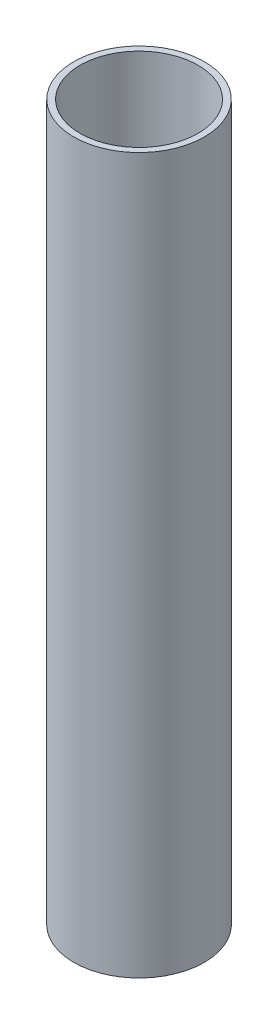
ISO-10303-21;
HEADER;
FILE_DESCRIPTION(('STEP AP214'),'2;1');
FILE_NAME('part.step','',(''),(''),'','','');
FILE_SCHEMA(('AUTOMOTIVE_DESIGN { 1 0 10303 214 1 1 1 1 }'));
ENDSEC;
DATA;
#1=APPLICATION_CONTEXT('core data for automotive mechanical design processes');
#2=APPLICATION_PROTOCOL_DEFINITION('international standard','automotive_design',2000,#1);
#3=PRODUCT_CONTEXT('',#1,'mechanical');
#4=PRODUCT('Part','Part','',(#3));
#5=PRODUCT_RELATED_PRODUCT_CATEGORY('part','',(#4));
#6=PRODUCT_DEFINITION_FORMATION('','',#4);
#7=PRODUCT_DEFINITION_CONTEXT('part definition',#1,'design');
#8=PRODUCT_DEFINITION('design','',#6,#7);
#9=PRODUCT_DEFINITION_SHAPE('','',#8);
#10=(LENGTH_UNIT() NAMED_UNIT(*) SI_UNIT(.MILLI.,.METRE.));
#11=(NAMED_UNIT(*) PLANE_ANGLE_UNIT() SI_UNIT($,.RADIAN.));
#12=(NAMED_UNIT(*) SI_UNIT($,.STERADIAN.) SOLID_ANGLE_UNIT());
#13=UNCERTAINTY_MEASURE_WITH_UNIT(LENGTH_MEASURE(1.E-05),#10,'distance_accuracy_value','');
#14=(GEOMETRIC_REPRESENTATION_CONTEXT(3) GLOBAL_UNCERTAINTY_ASSIGNED_CONTEXT((#13)) GLOBAL_UNIT_ASSIGNED_CONTEXT((#10,
#11,#12)) REPRESENTATION_CONTEXT('',''));
#15=CARTESIAN_POINT('',(0.,0.,0.));
#16=DIRECTION('',(0.,0.,1.));
#17=DIRECTION('',(1.,0.,0.));
#18=AXIS2_PLACEMENT_3D('',#15,#16,#17);
#19=CARTESIAN_POINT('',(0.,230.,0.));
#20=DIRECTION('',(0.,1.,0.));
#21=DIRECTION('',(0.,0.,1.));
#22=AXIS2_PLACEMENT_3D('',#19,#20,#21);
#23=PLANE('',#22);
#24=CARTESIAN_POINT('',(0.,230.,0.));
#25=DIRECTION('',(0.,1.,0.));
#26=DIRECTION('',(1.,0.,0.));
#27=AXIS2_PLACEMENT_3D('',#24,#25,#26);
#28=CIRCLE('',#27,21.);
#29=CARTESIAN_POINT('',(21.,230.,0.));
#30=VERTEX_POINT('',#29);
#31=EDGE_CURVE('E11',#30,#30,#28,.T.);
#32=ORIENTED_EDGE('',*,*,#31,.T.);
#33=EDGE_LOOP('',(#32));
#34=FACE_BOUND('',#33,.T.);
#35=CARTESIAN_POINT('',(0.,230.,0.));
#36=DIRECTION('',(0.,1.,0.));
#37=DIRECTION('',(0.,0.,1.));
#38=AXIS2_PLACEMENT_3D('',#35,#36,#37);
#39=CIRCLE('',#38,19.);
#40=CARTESIAN_POINT('',(0.,230.,19.));
#41=VERTEX_POINT('',#40);
#42=EDGE_CURVE('E58',#41,#41,#39,.T.);
#43=ORIENTED_EDGE('',*,*,#42,.F.);
#44=EDGE_LOOP('',(#43));
#45=FACE_BOUND('',#44,.T.);
#46=ADVANCED_FACE('F45',(#34,#45),#23,.T.);
#47=CARTESIAN_POINT('',(0.,0.,0.));
#48=DIRECTION('',(0.,1.,0.));
#49=DIRECTION('',(0.,0.,1.));
#50=AXIS2_PLACEMENT_3D('',#47,#48,#49);
#51=PLANE('',#50);
#52=CARTESIAN_POINT('',(0.,0.,0.));
#53=DIRECTION('',(0.,1.,0.));
#54=DIRECTION('',(1.,0.,0.));
#55=AXIS2_PLACEMENT_3D('',#52,#53,#54);
#56=CIRCLE('',#55,21.);
#57=CARTESIAN_POINT('',(21.,0.,0.));
#58=VERTEX_POINT('',#57);
#59=EDGE_CURVE('E49',#58,#58,#56,.T.);
#60=ORIENTED_EDGE('',*,*,#59,.F.);
#61=EDGE_LOOP('',(#60));
#62=FACE_BOUND('',#61,.T.);
#63=CARTESIAN_POINT('',(0.,0.,0.));
#64=DIRECTION('',(0.,1.,0.));
#65=DIRECTION('',(0.,0.,1.));
#66=AXIS2_PLACEMENT_3D('',#63,#64,#65);
#67=CIRCLE('',#66,19.);
#68=CARTESIAN_POINT('',(0.,0.,19.));
#69=VERTEX_POINT('',#68);
#70=EDGE_CURVE('E60',#69,#69,#67,.T.);
#71=ORIENTED_EDGE('',*,*,#70,.T.);
#72=EDGE_LOOP('',(#71));
#73=FACE_BOUND('',#72,.T.);
#74=ADVANCED_FACE('F72',(#62,#73),#51,.F.);
#75=CARTESIAN_POINT('',(0.,230.,0.));
#76=DIRECTION('',(0.,-1.,0.));
#77=DIRECTION('',(0.,0.,-1.));
#78=AXIS2_PLACEMENT_3D('',#75,#76,#77);
#79=CYLINDRICAL_SURFACE('',#78,21.);
#80=ORIENTED_EDGE('',*,*,#31,.F.);
#81=EDGE_LOOP('',(#80));
#82=FACE_BOUND('',#81,.T.);
#83=ORIENTED_EDGE('',*,*,#59,.T.);
#84=EDGE_LOOP('',(#83));
#85=FACE_BOUND('',#84,.T.);
#86=ADVANCED_FACE('F47',(#82,#85),#79,.T.);
#87=CARTESIAN_POINT('',(0.,230.,0.));
#88=DIRECTION('',(0.,-1.,0.));
#89=DIRECTION('',(0.,0.,-1.));
#90=AXIS2_PLACEMENT_3D('',#87,#88,#89);
#91=CYLINDRICAL_SURFACE('',#90,19.);
#92=ORIENTED_EDGE('',*,*,#42,.T.);
#93=EDGE_LOOP('',(#92));
#94=FACE_BOUND('',#93,.T.);
#95=ORIENTED_EDGE('',*,*,#70,.F.);
#96=EDGE_LOOP('',(#95));
#97=FACE_BOUND('',#96,.T.);
#98=ADVANCED_FACE('F68',(#94,#97),#91,.F.);
#99=CLOSED_SHELL('',(#46,#74,#86,#98));
#100=MANIFOLD_SOLID_BREP('B2',#99);
#101=ADVANCED_BREP_SHAPE_REPRESENTATION('',(#18,#100),#14);
#102=SHAPE_DEFINITION_REPRESENTATION(#9,#101);
ENDSEC;
END-ISO-10303-21;
